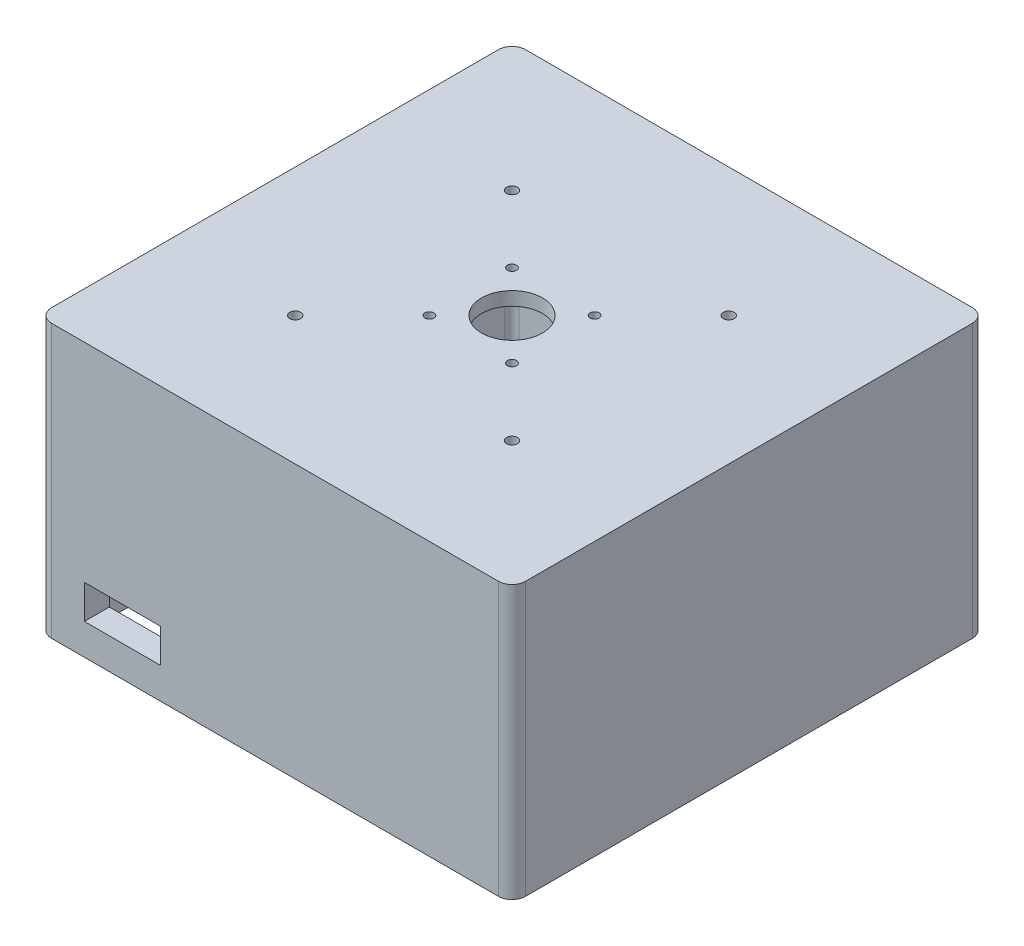
ISO-10303-21;
HEADER;
FILE_DESCRIPTION(('STEP AP214'),'2;1');
FILE_NAME('part.step','',(''),(''),'','','');
FILE_SCHEMA(('AUTOMOTIVE_DESIGN { 1 0 10303 214 1 1 1 1 }'));
ENDSEC;
DATA;
#1=APPLICATION_CONTEXT('core data for automotive mechanical design processes');
#2=APPLICATION_PROTOCOL_DEFINITION('international standard','automotive_design',2000,#1);
#3=PRODUCT_CONTEXT('',#1,'mechanical');
#4=PRODUCT('Part','Part','',(#3));
#5=PRODUCT_RELATED_PRODUCT_CATEGORY('part','',(#4));
#6=PRODUCT_DEFINITION_FORMATION('','',#4);
#7=PRODUCT_DEFINITION_CONTEXT('part definition',#1,'design');
#8=PRODUCT_DEFINITION('design','',#6,#7);
#9=PRODUCT_DEFINITION_SHAPE('','',#8);
#10=(LENGTH_UNIT() NAMED_UNIT(*) SI_UNIT(.MILLI.,.METRE.));
#11=(NAMED_UNIT(*) PLANE_ANGLE_UNIT() SI_UNIT($,.RADIAN.));
#12=(NAMED_UNIT(*) SI_UNIT($,.STERADIAN.) SOLID_ANGLE_UNIT());
#13=UNCERTAINTY_MEASURE_WITH_UNIT(LENGTH_MEASURE(1.E-05),#10,'distance_accuracy_value','');
#14=(GEOMETRIC_REPRESENTATION_CONTEXT(3) GLOBAL_UNCERTAINTY_ASSIGNED_CONTEXT((#13)) GLOBAL_UNIT_ASSIGNED_CONTEXT((#10,
#11,#12)) REPRESENTATION_CONTEXT('',''));
#15=CARTESIAN_POINT('',(0.,0.,0.));
#16=DIRECTION('',(0.,0.,1.));
#17=DIRECTION('',(1.,0.,0.));
#18=AXIS2_PLACEMENT_3D('',#15,#16,#17);
#19=CARTESIAN_POINT('',(0.,-59.182,88.9));
#20=DIRECTION('',(0.,0.,1.));
#21=DIRECTION('',(1.,0.,0.));
#22=AXIS2_PLACEMENT_3D('',#19,#20,#21);
#23=PLANE('',#22);
#24=DIRECTION('',(0.,-1.,0.));
#25=VECTOR('',#24,1.);
#26=CARTESIAN_POINT('',(-71.5107409869842,-34.8243411574687,88.9));
#27=LINE('',#26,#25);
#28=CARTESIAN_POINT('',(-71.5107409869842,-34.8243411574687,88.9));
#29=VERTEX_POINT('',#28);
#30=CARTESIAN_POINT('',(-71.5107409869842,-47.5243411574687,88.9));
#31=VERTEX_POINT('',#30);
#32=EDGE_CURVE('E78',#29,#31,#27,.T.);
#33=ORIENTED_EDGE('',*,*,#32,.F.);
#34=DIRECTION('',(-1.,0.,0.));
#35=VECTOR('',#34,1.);
#36=CARTESIAN_POINT('',(-71.5107409869842,-34.8243411574687,88.9));
#37=LINE('',#36,#35);
#38=CARTESIAN_POINT('',(-42.9357409869842,-34.8243411574687,88.9));
#39=VERTEX_POINT('',#38);
#40=EDGE_CURVE('E219',#39,#29,#37,.T.);
#41=ORIENTED_EDGE('',*,*,#40,.F.);
#42=DIRECTION('',(0.,1.,0.));
#43=VECTOR('',#42,1.);
#44=CARTESIAN_POINT('',(-42.9357409869842,-34.8243411574687,88.9));
#45=LINE('',#44,#43);
#46=CARTESIAN_POINT('',(-42.9357409869842,-47.5243411574687,88.9));
#47=VERTEX_POINT('',#46);
#48=EDGE_CURVE('E202',#47,#39,#45,.T.);
#49=ORIENTED_EDGE('',*,*,#48,.F.);
#50=DIRECTION('',(1.,0.,0.));
#51=VECTOR('',#50,1.);
#52=CARTESIAN_POINT('',(-71.5107409869842,-47.5243411574687,88.9));
#53=LINE('',#52,#51);
#54=EDGE_CURVE('E212',#31,#47,#53,.T.);
#55=ORIENTED_EDGE('',*,*,#54,.F.);
#56=EDGE_LOOP('',(#33,#41,#49,#55));
#57=FACE_BOUND('',#56,.T.);
#58=DIRECTION('',(1.,0.,0.));
#59=VECTOR('',#58,1.);
#60=CARTESIAN_POINT('',(0.,-59.182,88.9));
#61=LINE('',#60,#59);
#62=CARTESIAN_POINT('',(-83.82,-59.182,88.9));
#63=VERTEX_POINT('',#62);
#64=CARTESIAN_POINT('',(83.82,-59.182,88.9));
#65=VERTEX_POINT('',#64);
#66=EDGE_CURVE('E357',#63,#65,#61,.T.);
#67=ORIENTED_EDGE('',*,*,#66,.T.);
#68=DIRECTION('',(0.,1.,0.));
#69=VECTOR('',#68,1.);
#70=CARTESIAN_POINT('',(83.82,-59.182,88.9));
#71=LINE('',#70,#69);
#72=CARTESIAN_POINT('',(83.82,43.18,88.9));
#73=VERTEX_POINT('',#72);
#74=EDGE_CURVE('E421',#65,#73,#71,.T.);
#75=ORIENTED_EDGE('',*,*,#74,.T.);
#76=DIRECTION('',(-1.,0.,0.));
#77=VECTOR('',#76,1.);
#78=CARTESIAN_POINT('',(0.,43.18,88.9));
#79=LINE('',#78,#77);
#80=CARTESIAN_POINT('',(-83.82,43.18,88.9));
#81=VERTEX_POINT('',#80);
#82=EDGE_CURVE('E313',#73,#81,#79,.T.);
#83=ORIENTED_EDGE('',*,*,#82,.T.);
#84=DIRECTION('',(0.,1.,0.));
#85=VECTOR('',#84,1.);
#86=CARTESIAN_POINT('',(-83.82,-59.182,88.9));
#87=LINE('',#86,#85);
#88=EDGE_CURVE('E418',#81,#63,#87,.F.);
#89=ORIENTED_EDGE('',*,*,#88,.T.);
#90=EDGE_LOOP('',(#67,#75,#83,#89));
#91=FACE_BOUND('',#90,.T.);
#92=ADVANCED_FACE('F62',(#57,#91),#23,.T.);
#93=CARTESIAN_POINT('',(-88.9,-59.182,0.));
#94=DIRECTION('',(1.,0.,0.));
#95=DIRECTION('',(0.,0.,-1.));
#96=AXIS2_PLACEMENT_3D('',#93,#94,#95);
#97=PLANE('',#96);
#98=DIRECTION('',(0.,0.,1.));
#99=VECTOR('',#98,1.);
#100=CARTESIAN_POINT('',(-88.9,43.18,0.));
#101=LINE('',#100,#99);
#102=CARTESIAN_POINT('',(-88.9,43.18,-83.82));
#103=VERTEX_POINT('',#102);
#104=CARTESIAN_POINT('',(-88.9,43.18,83.82));
#105=VERTEX_POINT('',#104);
#106=EDGE_CURVE('E306',#103,#105,#101,.T.);
#107=ORIENTED_EDGE('',*,*,#106,.F.);
#108=DIRECTION('',(0.,1.,0.));
#109=VECTOR('',#108,1.);
#110=CARTESIAN_POINT('',(-88.9,-59.182,-83.82));
#111=LINE('',#110,#109);
#112=CARTESIAN_POINT('',(-88.9,-59.182,-83.82));
#113=VERTEX_POINT('',#112);
#114=EDGE_CURVE('E415',#103,#113,#111,.F.);
#115=ORIENTED_EDGE('',*,*,#114,.T.);
#116=DIRECTION('',(0.,0.,-1.));
#117=VECTOR('',#116,1.);
#118=CARTESIAN_POINT('',(-88.9,-59.182,0.));
#119=LINE('',#118,#117);
#120=CARTESIAN_POINT('',(-88.9,-59.182,83.82));
#121=VERTEX_POINT('',#120);
#122=EDGE_CURVE('E369',#121,#113,#119,.T.);
#123=ORIENTED_EDGE('',*,*,#122,.F.);
#124=DIRECTION('',(0.,1.,0.));
#125=VECTOR('',#124,1.);
#126=CARTESIAN_POINT('',(-88.9,43.18,83.82));
#127=LINE('',#126,#125);
#128=EDGE_CURVE('E411',#121,#105,#127,.T.);
#129=ORIENTED_EDGE('',*,*,#128,.T.);
#130=EDGE_LOOP('',(#107,#115,#123,#129));
#131=FACE_BOUND('',#130,.T.);
#132=ADVANCED_FACE('F522',(#131),#97,.F.);
#133=CARTESIAN_POINT('',(0.,-59.182,-88.9));
#134=DIRECTION('',(0.,0.,1.));
#135=DIRECTION('',(1.,0.,0.));
#136=AXIS2_PLACEMENT_3D('',#133,#134,#135);
#137=PLANE('',#136);
#138=DIRECTION('',(-1.,0.,0.));
#139=VECTOR('',#138,1.);
#140=CARTESIAN_POINT('',(0.,43.18,-88.9));
#141=LINE('',#140,#139);
#142=CARTESIAN_POINT('',(83.82,43.18,-88.9));
#143=VERTEX_POINT('',#142);
#144=CARTESIAN_POINT('',(-83.82,43.18,-88.9));
#145=VERTEX_POINT('',#144);
#146=EDGE_CURVE('E321',#143,#145,#141,.T.);
#147=ORIENTED_EDGE('',*,*,#146,.F.);
#148=DIRECTION('',(0.,1.,0.));
#149=VECTOR('',#148,1.);
#150=CARTESIAN_POINT('',(83.82,-59.182,-88.9));
#151=LINE('',#150,#149);
#152=CARTESIAN_POINT('',(83.82,-59.182,-88.9));
#153=VERTEX_POINT('',#152);
#154=EDGE_CURVE('E396',#143,#153,#151,.F.);
#155=ORIENTED_EDGE('',*,*,#154,.T.);
#156=DIRECTION('',(1.,0.,0.));
#157=VECTOR('',#156,1.);
#158=CARTESIAN_POINT('',(0.,-59.182,-88.9));
#159=LINE('',#158,#157);
#160=CARTESIAN_POINT('',(-83.82,-59.182,-88.9));
#161=VERTEX_POINT('',#160);
#162=EDGE_CURVE('E365',#161,#153,#159,.T.);
#163=ORIENTED_EDGE('',*,*,#162,.F.);
#164=DIRECTION('',(0.,1.,0.));
#165=VECTOR('',#164,1.);
#166=CARTESIAN_POINT('',(-83.82,-59.182,-88.9));
#167=LINE('',#166,#165);
#168=EDGE_CURVE('E392',#161,#145,#167,.T.);
#169=ORIENTED_EDGE('',*,*,#168,.T.);
#170=EDGE_LOOP('',(#147,#155,#163,#169));
#171=FACE_BOUND('',#170,.T.);
#172=ADVANCED_FACE('F529',(#171),#137,.F.);
#173=CARTESIAN_POINT('',(79.5394277392496,-59.182,0.));
#174=DIRECTION('',(1.,0.,0.));
#175=DIRECTION('',(0.,0.,-1.));
#176=AXIS2_PLACEMENT_3D('',#173,#174,#175);
#177=PLANE('',#176);
#178=DIRECTION('',(0.,0.,-1.));
#179=VECTOR('',#178,1.);
#180=CARTESIAN_POINT('',(79.5394277392496,-59.182,0.));
#181=LINE('',#180,#179);
#182=CARTESIAN_POINT('',(79.5394277392496,-59.182,76.9994277392495));
#183=VERTEX_POINT('',#182);
#184=CARTESIAN_POINT('',(79.5394277392496,-59.182,-76.9994277392495));
#185=VERTEX_POINT('',#184);
#186=EDGE_CURVE('E341',#183,#185,#181,.T.);
#187=ORIENTED_EDGE('',*,*,#186,.F.);
#188=DIRECTION('',(0.,1.,0.));
#189=VECTOR('',#188,1.);
#190=CARTESIAN_POINT('',(79.5394277392496,38.1,76.9994277392495));
#191=LINE('',#190,#189);
#192=CARTESIAN_POINT('',(79.5394277392496,38.1,76.9994277392495));
#193=VERTEX_POINT('',#192);
#194=EDGE_CURVE('E461',#183,#193,#191,.T.);
#195=ORIENTED_EDGE('',*,*,#194,.T.);
#196=DIRECTION('',(0.,0.,-1.));
#197=VECTOR('',#196,1.);
#198=CARTESIAN_POINT('',(79.5394277392496,38.1,0.));
#199=LINE('',#198,#197);
#200=CARTESIAN_POINT('',(79.5394277392496,38.1,-76.9994277392495));
#201=VERTEX_POINT('',#200);
#202=EDGE_CURVE('E325',#193,#201,#199,.T.);
#203=ORIENTED_EDGE('',*,*,#202,.T.);
#204=DIRECTION('',(0.,1.,0.));
#205=VECTOR('',#204,1.);
#206=CARTESIAN_POINT('',(79.5394277392496,-59.182,-76.9994277392495));
#207=LINE('',#206,#205);
#208=EDGE_CURVE('E458',#201,#185,#207,.F.);
#209=ORIENTED_EDGE('',*,*,#208,.T.);
#210=EDGE_LOOP('',(#187,#195,#203,#209));
#211=FACE_BOUND('',#210,.T.);
#212=ADVANCED_FACE('F482',(#211),#177,.F.);
#213=CARTESIAN_POINT('',(0.,-59.182,-79.5394277392495));
#214=DIRECTION('',(0.,0.,1.));
#215=DIRECTION('',(1.,0.,0.));
#216=AXIS2_PLACEMENT_3D('',#213,#214,#215);
#217=PLANE('',#216);
#218=DIRECTION('',(1.,0.,0.));
#219=VECTOR('',#218,1.);
#220=CARTESIAN_POINT('',(0.,38.1,-79.5394277392495));
#221=LINE('',#220,#219);
#222=CARTESIAN_POINT('',(-76.9994277392495,38.1,-79.5394277392495));
#223=VERTEX_POINT('',#222);
#224=CARTESIAN_POINT('',(76.9994277392496,38.1,-79.5394277392495));
#225=VERTEX_POINT('',#224);
#226=EDGE_CURVE('E337',#223,#225,#221,.T.);
#227=ORIENTED_EDGE('',*,*,#226,.F.);
#228=DIRECTION('',(0.,1.,0.));
#229=VECTOR('',#228,1.);
#230=CARTESIAN_POINT('',(-76.9994277392495,-59.182,-79.5394277392495));
#231=LINE('',#230,#229);
#232=CARTESIAN_POINT('',(-76.9994277392495,-59.182,-79.5394277392495));
#233=VERTEX_POINT('',#232);
#234=EDGE_CURVE('E448',#223,#233,#231,.F.);
#235=ORIENTED_EDGE('',*,*,#234,.T.);
#236=DIRECTION('',(1.,0.,0.));
#237=VECTOR('',#236,1.);
#238=CARTESIAN_POINT('',(0.,-59.182,-79.5394277392495));
#239=LINE('',#238,#237);
#240=CARTESIAN_POINT('',(76.9994277392496,-59.182,-79.5394277392495));
#241=VERTEX_POINT('',#240);
#242=EDGE_CURVE('E353',#233,#241,#239,.T.);
#243=ORIENTED_EDGE('',*,*,#242,.T.);
#244=DIRECTION('',(0.,1.,0.));
#245=VECTOR('',#244,1.);
#246=CARTESIAN_POINT('',(76.9994277392496,-59.182,-79.5394277392495));
#247=LINE('',#246,#245);
#248=EDGE_CURVE('E444',#241,#225,#247,.T.);
#249=ORIENTED_EDGE('',*,*,#248,.T.);
#250=EDGE_LOOP('',(#227,#235,#243,#249));
#251=FACE_BOUND('',#250,.T.);
#252=ADVANCED_FACE('F507',(#251),#217,.T.);
#253=CARTESIAN_POINT('',(-79.5394277392495,-59.182,0.));
#254=DIRECTION('',(1.,0.,0.));
#255=DIRECTION('',(0.,0.,-1.));
#256=AXIS2_PLACEMENT_3D('',#253,#254,#255);
#257=PLANE('',#256);
#258=DIRECTION('',(0.,0.,-1.));
#259=VECTOR('',#258,1.);
#260=CARTESIAN_POINT('',(-79.5394277392495,-59.182,0.));
#261=LINE('',#260,#259);
#262=CARTESIAN_POINT('',(-79.5394277392495,-59.182,76.9994277392495));
#263=VERTEX_POINT('',#262);
#264=CARTESIAN_POINT('',(-79.5394277392495,-59.182,-76.9994277392495));
#265=VERTEX_POINT('',#264);
#266=EDGE_CURVE('E349',#263,#265,#261,.T.);
#267=ORIENTED_EDGE('',*,*,#266,.T.);
#268=DIRECTION('',(0.,1.,0.));
#269=VECTOR('',#268,1.);
#270=CARTESIAN_POINT('',(-79.5394277392495,38.1,-76.9994277392495));
#271=LINE('',#270,#269);
#272=CARTESIAN_POINT('',(-79.5394277392495,38.1,-76.9994277392495));
#273=VERTEX_POINT('',#272);
#274=EDGE_CURVE('E428',#265,#273,#271,.T.);
#275=ORIENTED_EDGE('',*,*,#274,.T.);
#276=DIRECTION('',(0.,0.,-1.));
#277=VECTOR('',#276,1.);
#278=CARTESIAN_POINT('',(-79.5394277392495,38.1,0.));
#279=LINE('',#278,#277);
#280=CARTESIAN_POINT('',(-79.5394277392495,38.1,76.9994277392495));
#281=VERTEX_POINT('',#280);
#282=EDGE_CURVE('E333',#281,#273,#279,.T.);
#283=ORIENTED_EDGE('',*,*,#282,.F.);
#284=DIRECTION('',(0.,1.,0.));
#285=VECTOR('',#284,1.);
#286=CARTESIAN_POINT('',(-79.5394277392495,-59.182,76.9994277392495));
#287=LINE('',#286,#285);
#288=EDGE_CURVE('E425',#281,#263,#287,.F.);
#289=ORIENTED_EDGE('',*,*,#288,.T.);
#290=EDGE_LOOP('',(#267,#275,#283,#289));
#291=FACE_BOUND('',#290,.T.);
#292=ADVANCED_FACE('F498',(#291),#257,.T.);
#293=CARTESIAN_POINT('',(0.,-59.182,79.5394277392495));
#294=DIRECTION('',(0.,0.,1.));
#295=DIRECTION('',(1.,0.,0.));
#296=AXIS2_PLACEMENT_3D('',#293,#294,#295);
#297=PLANE('',#296);
#298=DIRECTION('',(1.,0.,0.));
#299=VECTOR('',#298,1.);
#300=CARTESIAN_POINT('',(-71.5107409869842,-34.8243411574687,79.5394277392495));
#301=LINE('',#300,#299);
#302=CARTESIAN_POINT('',(-71.5107409869842,-34.8243411574687,79.5394277392495));
#303=VERTEX_POINT('',#302);
#304=CARTESIAN_POINT('',(-42.9357409869842,-34.8243411574687,79.5394277392495));
#305=VERTEX_POINT('',#304);
#306=EDGE_CURVE('E888',#303,#305,#301,.T.);
#307=ORIENTED_EDGE('',*,*,#306,.F.);
#308=DIRECTION('',(0.,1.,0.));
#309=VECTOR('',#308,1.);
#310=CARTESIAN_POINT('',(-71.5107409869842,-34.8243411574687,79.5394277392495));
#311=LINE('',#310,#309);
#312=CARTESIAN_POINT('',(-71.5107409869842,-47.5243411574687,79.5394277392495));
#313=VERTEX_POINT('',#312);
#314=EDGE_CURVE('E237',#313,#303,#311,.T.);
#315=ORIENTED_EDGE('',*,*,#314,.F.);
#316=DIRECTION('',(-1.,0.,0.));
#317=VECTOR('',#316,1.);
#318=CARTESIAN_POINT('',(-71.5107409869842,-47.5243411574687,79.5394277392495));
#319=LINE('',#318,#317);
#320=CARTESIAN_POINT('',(-42.9357409869842,-47.5243411574687,79.5394277392495));
#321=VERTEX_POINT('',#320);
#322=EDGE_CURVE('E233',#321,#313,#319,.T.);
#323=ORIENTED_EDGE('',*,*,#322,.F.);
#324=DIRECTION('',(0.,-1.,0.));
#325=VECTOR('',#324,1.);
#326=CARTESIAN_POINT('',(-42.9357409869842,-34.8243411574687,79.5394277392495));
#327=LINE('',#326,#325);
#328=EDGE_CURVE('E205',#305,#321,#327,.T.);
#329=ORIENTED_EDGE('',*,*,#328,.F.);
#330=EDGE_LOOP('',(#307,#315,#323,#329));
#331=FACE_BOUND('',#330,.T.);
#332=DIRECTION('',(1.,0.,0.));
#333=VECTOR('',#332,1.);
#334=CARTESIAN_POINT('',(0.,-59.182,79.5394277392495));
#335=LINE('',#334,#333);
#336=CARTESIAN_POINT('',(-76.9994277392495,-59.182,79.5394277392495));
#337=VERTEX_POINT('',#336);
#338=CARTESIAN_POINT('',(76.9994277392496,-59.182,79.5394277392495));
#339=VERTEX_POINT('',#338);
#340=EDGE_CURVE('E345',#337,#339,#335,.T.);
#341=ORIENTED_EDGE('',*,*,#340,.F.);
#342=DIRECTION('',(0.,1.,0.));
#343=VECTOR('',#342,1.);
#344=CARTESIAN_POINT('',(-76.9994277392495,-59.182,79.5394277392495));
#345=LINE('',#344,#343);
#346=CARTESIAN_POINT('',(-76.9994277392495,38.1,79.5394277392495));
#347=VERTEX_POINT('',#346);
#348=EDGE_CURVE('E454',#337,#347,#345,.T.);
#349=ORIENTED_EDGE('',*,*,#348,.T.);
#350=DIRECTION('',(1.,0.,0.));
#351=VECTOR('',#350,1.);
#352=CARTESIAN_POINT('',(0.,38.1,79.5394277392495));
#353=LINE('',#352,#351);
#354=CARTESIAN_POINT('',(76.9994277392496,38.1,79.5394277392495));
#355=VERTEX_POINT('',#354);
#356=EDGE_CURVE('E329',#347,#355,#353,.T.);
#357=ORIENTED_EDGE('',*,*,#356,.T.);
#358=DIRECTION('',(0.,1.,0.));
#359=VECTOR('',#358,1.);
#360=CARTESIAN_POINT('',(76.9994277392496,-59.182,79.5394277392495));
#361=LINE('',#360,#359);
#362=EDGE_CURVE('E451',#355,#339,#361,.F.);
#363=ORIENTED_EDGE('',*,*,#362,.T.);
#364=EDGE_LOOP('',(#341,#349,#357,#363));
#365=FACE_BOUND('',#364,.T.);
#366=ADVANCED_FACE('F490',(#331,#365),#297,.F.);
#367=CARTESIAN_POINT('',(88.9,-59.182,0.));
#368=DIRECTION('',(1.,0.,0.));
#369=DIRECTION('',(0.,0.,-1.));
#370=AXIS2_PLACEMENT_3D('',#367,#368,#369);
#371=PLANE('',#370);
#372=DIRECTION('',(0.,0.,-1.));
#373=VECTOR('',#372,1.);
#374=CARTESIAN_POINT('',(88.9,-59.182,0.));
#375=LINE('',#374,#373);
#376=CARTESIAN_POINT('',(88.9,-59.182,83.82));
#377=VERTEX_POINT('',#376);
#378=CARTESIAN_POINT('',(88.9,-59.182,-83.82));
#379=VERTEX_POINT('',#378);
#380=EDGE_CURVE('E361',#377,#379,#375,.T.);
#381=ORIENTED_EDGE('',*,*,#380,.T.);
#382=DIRECTION('',(0.,1.,0.));
#383=VECTOR('',#382,1.);
#384=CARTESIAN_POINT('',(88.9,43.18,-83.82));
#385=LINE('',#384,#383);
#386=CARTESIAN_POINT('',(88.9,43.18,-83.82));
#387=VERTEX_POINT('',#386);
#388=EDGE_CURVE('E376',#379,#387,#385,.T.);
#389=ORIENTED_EDGE('',*,*,#388,.T.);
#390=DIRECTION('',(0.,0.,1.));
#391=VECTOR('',#390,1.);
#392=CARTESIAN_POINT('',(88.9,43.18,0.));
#393=LINE('',#392,#391);
#394=CARTESIAN_POINT('',(88.9,43.18,83.82));
#395=VERTEX_POINT('',#394);
#396=EDGE_CURVE('E317',#387,#395,#393,.T.);
#397=ORIENTED_EDGE('',*,*,#396,.T.);
#398=DIRECTION('',(0.,1.,0.));
#399=VECTOR('',#398,1.);
#400=CARTESIAN_POINT('',(88.9,-59.182,83.82));
#401=LINE('',#400,#399);
#402=EDGE_CURVE('E373',#395,#377,#401,.F.);
#403=ORIENTED_EDGE('',*,*,#402,.T.);
#404=EDGE_LOOP('',(#381,#389,#397,#403));
#405=FACE_BOUND('',#404,.T.);
#406=ADVANCED_FACE('F534',(#405),#371,.T.);
#407=CARTESIAN_POINT('',(0.,-59.182,0.));
#408=DIRECTION('',(0.,1.,0.));
#409=DIRECTION('',(0.,0.,1.));
#410=AXIS2_PLACEMENT_3D('',#407,#408,#409);
#411=PLANE('',#410);
#412=ORIENTED_EDGE('',*,*,#340,.T.);
#413=CARTESIAN_POINT('',(76.9994277392496,-59.182,76.9994277392495));
#414=DIRECTION('',(0.,1.,0.));
#415=DIRECTION('',(0.,0.,1.));
#416=AXIS2_PLACEMENT_3D('',#413,#414,#415);
#417=CIRCLE('',#416,2.54);
#418=EDGE_CURVE('E71',#339,#183,#417,.T.);
#419=ORIENTED_EDGE('',*,*,#418,.T.);
#420=ORIENTED_EDGE('',*,*,#186,.T.);
#421=CARTESIAN_POINT('',(76.9994277392496,-59.182,-76.9994277392495));
#422=DIRECTION('',(0.,1.,0.));
#423=DIRECTION('',(0.,0.,1.));
#424=AXIS2_PLACEMENT_3D('',#421,#422,#423);
#425=CIRCLE('',#424,2.54);
#426=EDGE_CURVE('E12',#185,#241,#425,.T.);
#427=ORIENTED_EDGE('',*,*,#426,.T.);
#428=ORIENTED_EDGE('',*,*,#242,.F.);
#429=CARTESIAN_POINT('',(-76.9994277392495,-59.182,-76.9994277392495));
#430=DIRECTION('',(0.,1.,0.));
#431=DIRECTION('',(0.,0.,1.));
#432=AXIS2_PLACEMENT_3D('',#429,#430,#431);
#433=CIRCLE('',#432,2.54);
#434=EDGE_CURVE('E465',#233,#265,#433,.T.);
#435=ORIENTED_EDGE('',*,*,#434,.T.);
#436=ORIENTED_EDGE('',*,*,#266,.F.);
#437=CARTESIAN_POINT('',(-76.9994277392495,-59.182,76.9994277392495));
#438=DIRECTION('',(0.,1.,0.));
#439=DIRECTION('',(0.,0.,1.));
#440=AXIS2_PLACEMENT_3D('',#437,#438,#439);
#441=CIRCLE('',#440,2.54);
#442=EDGE_CURVE('E468',#263,#337,#441,.T.);
#443=ORIENTED_EDGE('',*,*,#442,.T.);
#444=EDGE_LOOP('',(#412,#419,#420,#427,#428,#435,#436,#443));
#445=FACE_BOUND('',#444,.T.);
#446=ORIENTED_EDGE('',*,*,#162,.T.);
#447=CARTESIAN_POINT('',(83.82,-59.182,-83.82));
#448=DIRECTION('',(0.,1.,0.));
#449=DIRECTION('',(0.,0.,1.));
#450=AXIS2_PLACEMENT_3D('',#447,#448,#449);
#451=CIRCLE('',#450,5.08);
#452=EDGE_CURVE('E408',#153,#379,#451,.F.);
#453=ORIENTED_EDGE('',*,*,#452,.T.);
#454=ORIENTED_EDGE('',*,*,#380,.F.);
#455=CARTESIAN_POINT('',(83.82,-59.182,83.82));
#456=DIRECTION('',(0.,1.,0.));
#457=DIRECTION('',(0.,0.,1.));
#458=AXIS2_PLACEMENT_3D('',#455,#456,#457);
#459=CIRCLE('',#458,5.08);
#460=EDGE_CURVE('E402',#377,#65,#459,.F.);
#461=ORIENTED_EDGE('',*,*,#460,.T.);
#462=ORIENTED_EDGE('',*,*,#66,.F.);
#463=CARTESIAN_POINT('',(-83.82,-59.182,83.82));
#464=DIRECTION('',(0.,1.,0.));
#465=DIRECTION('',(0.,0.,1.));
#466=AXIS2_PLACEMENT_3D('',#463,#464,#465);
#467=CIRCLE('',#466,5.08);
#468=EDGE_CURVE('E399',#63,#121,#467,.F.);
#469=ORIENTED_EDGE('',*,*,#468,.T.);
#470=ORIENTED_EDGE('',*,*,#122,.T.);
#471=CARTESIAN_POINT('',(-83.82,-59.182,-83.82));
#472=DIRECTION('',(0.,1.,0.));
#473=DIRECTION('',(0.,0.,1.));
#474=AXIS2_PLACEMENT_3D('',#471,#472,#473);
#475=CIRCLE('',#474,5.08);
#476=EDGE_CURVE('E405',#113,#161,#475,.F.);
#477=ORIENTED_EDGE('',*,*,#476,.T.);
#478=EDGE_LOOP('',(#446,#453,#454,#461,#462,#469,#470,#477));
#479=FACE_BOUND('',#478,.T.);
#480=ADVANCED_FACE('F474',(#445,#479),#411,.F.);
#481=CARTESIAN_POINT('',(0.,38.1,0.));
#482=DIRECTION('',(0.,-1.,0.));
#483=DIRECTION('',(0.,0.,-1.));
#484=AXIS2_PLACEMENT_3D('',#481,#482,#483);
#485=PLANE('',#484);
#486=CARTESIAN_POINT('',(40.6599999999999,38.1,40.6600000000001));
#487=DIRECTION('',(0.,-1.,0.));
#488=DIRECTION('',(0.,0.,-1.));
#489=AXIS2_PLACEMENT_3D('',#486,#487,#488);
#490=CIRCLE('',#489,2.04999999999998);
#491=CARTESIAN_POINT('',(40.6599999999999,38.1,38.6100000000001));
#492=VERTEX_POINT('',#491);
#493=EDGE_CURVE('E236',#492,#492,#490,.F.);
#494=ORIENTED_EDGE('',*,*,#493,.T.);
#495=EDGE_LOOP('',(#494));
#496=FACE_BOUND('',#495,.T.);
#497=CARTESIAN_POINT('',(-40.6599999999999,38.1,40.6600000000001));
#498=DIRECTION('',(0.,-1.,0.));
#499=DIRECTION('',(0.,0.,-1.));
#500=AXIS2_PLACEMENT_3D('',#497,#498,#499);
#501=CIRCLE('',#500,2.04999999999998);
#502=CARTESIAN_POINT('',(-40.6599999999999,38.1,38.6100000000002));
#503=VERTEX_POINT('',#502);
#504=EDGE_CURVE('E248',#503,#503,#501,.F.);
#505=ORIENTED_EDGE('',*,*,#504,.T.);
#506=EDGE_LOOP('',(#505));
#507=FACE_BOUND('',#506,.T.);
#508=CARTESIAN_POINT('',(-40.66,38.1,-40.66));
#509=DIRECTION('',(0.,-1.,0.));
#510=DIRECTION('',(0.,0.,-1.));
#511=AXIS2_PLACEMENT_3D('',#508,#509,#510);
#512=CIRCLE('',#511,2.04999999999999);
#513=CARTESIAN_POINT('',(-40.66,38.1,-42.71));
#514=VERTEX_POINT('',#513);
#515=EDGE_CURVE('E238',#514,#514,#512,.F.);
#516=ORIENTED_EDGE('',*,*,#515,.T.);
#517=EDGE_LOOP('',(#516));
#518=FACE_BOUND('',#517,.T.);
#519=CARTESIAN_POINT('',(40.6599999999999,38.1,-40.66));
#520=DIRECTION('',(0.,-1.,0.));
#521=DIRECTION('',(0.,0.,-1.));
#522=AXIS2_PLACEMENT_3D('',#519,#520,#521);
#523=CIRCLE('',#522,2.04999999999999);
#524=CARTESIAN_POINT('',(40.6599999999999,38.1,-42.71));
#525=VERTEX_POINT('',#524);
#526=EDGE_CURVE('E265',#525,#525,#523,.F.);
#527=ORIENTED_EDGE('',*,*,#526,.T.);
#528=EDGE_LOOP('',(#527));
#529=FACE_BOUND('',#528,.T.);
#530=CARTESIAN_POINT('',(15.4999999999998,38.1,15.5000000000001));
#531=DIRECTION('',(0.,-1.,0.));
#532=DIRECTION('',(0.,0.,-1.));
#533=AXIS2_PLACEMENT_3D('',#530,#531,#532);
#534=CIRCLE('',#533,1.69999999999993);
#535=CARTESIAN_POINT('',(15.4999999999998,38.1,13.8000000000002));
#536=VERTEX_POINT('',#535);
#537=EDGE_CURVE('E297',#536,#536,#534,.T.);
#538=ORIENTED_EDGE('',*,*,#537,.F.);
#539=EDGE_LOOP('',(#538));
#540=FACE_BOUND('',#539,.T.);
#541=CARTESIAN_POINT('',(15.4999999999999,38.1,-15.5));
#542=DIRECTION('',(0.,-1.,0.));
#543=DIRECTION('',(0.,0.,-1.));
#544=AXIS2_PLACEMENT_3D('',#541,#542,#543);
#545=CIRCLE('',#544,1.69999999999996);
#546=CARTESIAN_POINT('',(15.4999999999999,38.1,-17.2));
#547=VERTEX_POINT('',#546);
#548=EDGE_CURVE('E293',#547,#547,#545,.T.);
#549=ORIENTED_EDGE('',*,*,#548,.F.);
#550=EDGE_LOOP('',(#549));
#551=FACE_BOUND('',#550,.T.);
#552=CARTESIAN_POINT('',(-15.5,38.1,-15.5));
#553=DIRECTION('',(0.,-1.,0.));
#554=DIRECTION('',(0.,0.,-1.));
#555=AXIS2_PLACEMENT_3D('',#552,#553,#554);
#556=CIRCLE('',#555,1.69999999999996);
#557=CARTESIAN_POINT('',(-15.5,38.1,-17.2));
#558=VERTEX_POINT('',#557);
#559=EDGE_CURVE('E289',#558,#558,#556,.T.);
#560=ORIENTED_EDGE('',*,*,#559,.F.);
#561=EDGE_LOOP('',(#560));
#562=FACE_BOUND('',#561,.T.);
#563=CARTESIAN_POINT('',(-15.5,38.1,15.5000000000001));
#564=DIRECTION('',(0.,-1.,0.));
#565=DIRECTION('',(0.,0.,-1.));
#566=AXIS2_PLACEMENT_3D('',#563,#564,#565);
#567=CIRCLE('',#566,1.69999999999995);
#568=CARTESIAN_POINT('',(-15.5,38.1,13.8000000000002));
#569=VERTEX_POINT('',#568);
#570=EDGE_CURVE('E285',#569,#569,#567,.T.);
#571=ORIENTED_EDGE('',*,*,#570,.F.);
#572=EDGE_LOOP('',(#571));
#573=FACE_BOUND('',#572,.T.);
#574=CARTESIAN_POINT('',(0.,38.1,0.));
#575=DIRECTION('',(0.,1.,0.));
#576=DIRECTION('',(0.,0.,1.));
#577=AXIS2_PLACEMENT_3D('',#574,#575,#576);
#578=CIRCLE('',#577,11.43);
#579=CARTESIAN_POINT('',(0.,38.1,11.43));
#580=VERTEX_POINT('',#579);
#581=EDGE_CURVE('E301',#580,#580,#578,.T.);
#582=ORIENTED_EDGE('',*,*,#581,.T.);
#583=EDGE_LOOP('',(#582));
#584=FACE_BOUND('',#583,.T.);
#585=ORIENTED_EDGE('',*,*,#282,.T.);
#586=CARTESIAN_POINT('',(-76.9994277392495,38.1,-76.9994277392495));
#587=DIRECTION('',(0.,-1.,0.));
#588=DIRECTION('',(0.,0.,-1.));
#589=AXIS2_PLACEMENT_3D('',#586,#587,#588);
#590=CIRCLE('',#589,2.54);
#591=EDGE_CURVE('E441',#273,#223,#590,.T.);
#592=ORIENTED_EDGE('',*,*,#591,.T.);
#593=ORIENTED_EDGE('',*,*,#226,.T.);
#594=CARTESIAN_POINT('',(76.9994277392496,38.1,-76.9994277392495));
#595=DIRECTION('',(0.,-1.,0.));
#596=DIRECTION('',(0.,0.,-1.));
#597=AXIS2_PLACEMENT_3D('',#594,#595,#596);
#598=CIRCLE('',#597,2.54);
#599=EDGE_CURVE('E432',#225,#201,#598,.T.);
#600=ORIENTED_EDGE('',*,*,#599,.T.);
#601=ORIENTED_EDGE('',*,*,#202,.F.);
#602=CARTESIAN_POINT('',(76.9994277392496,38.1,76.9994277392495));
#603=DIRECTION('',(0.,-1.,0.));
#604=DIRECTION('',(0.,0.,-1.));
#605=AXIS2_PLACEMENT_3D('',#602,#603,#604);
#606=CIRCLE('',#605,2.54);
#607=EDGE_CURVE('E435',#193,#355,#606,.T.);
#608=ORIENTED_EDGE('',*,*,#607,.T.);
#609=ORIENTED_EDGE('',*,*,#356,.F.);
#610=CARTESIAN_POINT('',(-76.9994277392495,38.1,76.9994277392495));
#611=DIRECTION('',(0.,-1.,0.));
#612=DIRECTION('',(0.,0.,-1.));
#613=AXIS2_PLACEMENT_3D('',#610,#611,#612);
#614=CIRCLE('',#613,2.54);
#615=EDGE_CURVE('E438',#347,#281,#614,.T.);
#616=ORIENTED_EDGE('',*,*,#615,.T.);
#617=EDGE_LOOP('',(#585,#592,#593,#600,#601,#608,#609,#616));
#618=FACE_BOUND('',#617,.T.);
#619=ADVANCED_FACE('F488',(#496,#507,#518,#529,#540,#551,#562,#573,#584,#618),#485,.T.);
#620=CARTESIAN_POINT('',(0.,43.18,0.));
#621=DIRECTION('',(0.,-1.,0.));
#622=DIRECTION('',(0.,0.,-1.));
#623=AXIS2_PLACEMENT_3D('',#620,#621,#622);
#624=PLANE('',#623);
#625=CARTESIAN_POINT('',(40.6599999999999,43.18,40.6600000000001));
#626=DIRECTION('',(0.,1.,0.));
#627=DIRECTION('',(0.,0.,1.));
#628=AXIS2_PLACEMENT_3D('',#625,#626,#627);
#629=CIRCLE('',#628,2.04999999999998);
#630=CARTESIAN_POINT('',(40.6599999999999,43.18,42.7100000000001));
#631=VERTEX_POINT('',#630);
#632=EDGE_CURVE('E252',#631,#631,#629,.T.);
#633=ORIENTED_EDGE('',*,*,#632,.F.);
#634=EDGE_LOOP('',(#633));
#635=FACE_BOUND('',#634,.T.);
#636=CARTESIAN_POINT('',(-40.6599999999999,43.18,40.6600000000001));
#637=DIRECTION('',(0.,1.,0.));
#638=DIRECTION('',(0.,0.,-1.));
#639=AXIS2_PLACEMENT_3D('',#636,#637,#638);
#640=CIRCLE('',#639,2.04999999999998);
#641=CARTESIAN_POINT('',(-40.6599999999999,43.18,38.6100000000002));
#642=VERTEX_POINT('',#641);
#643=EDGE_CURVE('E243',#642,#642,#640,.T.);
#644=ORIENTED_EDGE('',*,*,#643,.F.);
#645=EDGE_LOOP('',(#644));
#646=FACE_BOUND('',#645,.T.);
#647=CARTESIAN_POINT('',(-40.66,43.18,-40.66));
#648=DIRECTION('',(0.,1.,0.));
#649=DIRECTION('',(0.,0.,1.));
#650=AXIS2_PLACEMENT_3D('',#647,#648,#649);
#651=CIRCLE('',#650,2.04999999999999);
#652=CARTESIAN_POINT('',(-40.66,43.18,-38.61));
#653=VERTEX_POINT('',#652);
#654=EDGE_CURVE('E242',#653,#653,#651,.T.);
#655=ORIENTED_EDGE('',*,*,#654,.F.);
#656=EDGE_LOOP('',(#655));
#657=FACE_BOUND('',#656,.T.);
#658=CARTESIAN_POINT('',(40.6599999999999,43.18,-40.66));
#659=DIRECTION('',(0.,1.,0.));
#660=DIRECTION('',(0.,0.,-1.));
#661=AXIS2_PLACEMENT_3D('',#658,#659,#660);
#662=CIRCLE('',#661,2.04999999999999);
#663=CARTESIAN_POINT('',(40.6599999999999,43.18,-42.71));
#664=VERTEX_POINT('',#663);
#665=EDGE_CURVE('E247',#664,#664,#662,.T.);
#666=ORIENTED_EDGE('',*,*,#665,.F.);
#667=EDGE_LOOP('',(#666));
#668=FACE_BOUND('',#667,.T.);
#669=CARTESIAN_POINT('',(15.4999999999998,43.18,15.5000000000001));
#670=DIRECTION('',(0.,1.,0.));
#671=DIRECTION('',(0.,0.,1.));
#672=AXIS2_PLACEMENT_3D('',#669,#670,#671);
#673=CIRCLE('',#672,1.69999999999993);
#674=CARTESIAN_POINT('',(15.4999999999998,43.18,17.2));
#675=VERTEX_POINT('',#674);
#676=EDGE_CURVE('E269',#675,#675,#673,.T.);
#677=ORIENTED_EDGE('',*,*,#676,.F.);
#678=EDGE_LOOP('',(#677));
#679=FACE_BOUND('',#678,.T.);
#680=CARTESIAN_POINT('',(15.4999999999999,43.18,-15.5));
#681=DIRECTION('',(0.,1.,0.));
#682=DIRECTION('',(0.,0.,-1.));
#683=AXIS2_PLACEMENT_3D('',#680,#681,#682);
#684=CIRCLE('',#683,1.69999999999996);
#685=CARTESIAN_POINT('',(15.4999999999999,43.18,-17.2));
#686=VERTEX_POINT('',#685);
#687=EDGE_CURVE('E275',#686,#686,#684,.T.);
#688=ORIENTED_EDGE('',*,*,#687,.F.);
#689=EDGE_LOOP('',(#688));
#690=FACE_BOUND('',#689,.T.);
#691=CARTESIAN_POINT('',(-15.5,43.18,-15.5));
#692=DIRECTION('',(0.,1.,0.));
#693=DIRECTION('',(0.,0.,1.));
#694=AXIS2_PLACEMENT_3D('',#691,#692,#693);
#695=CIRCLE('',#694,1.69999999999996);
#696=CARTESIAN_POINT('',(-15.5,43.18,-13.8));
#697=VERTEX_POINT('',#696);
#698=EDGE_CURVE('E270',#697,#697,#695,.T.);
#699=ORIENTED_EDGE('',*,*,#698,.F.);
#700=EDGE_LOOP('',(#699));
#701=FACE_BOUND('',#700,.T.);
#702=CARTESIAN_POINT('',(-15.5,43.18,15.5000000000001));
#703=DIRECTION('',(0.,1.,0.));
#704=DIRECTION('',(0.,0.,-1.));
#705=AXIS2_PLACEMENT_3D('',#702,#703,#704);
#706=CIRCLE('',#705,1.69999999999995);
#707=CARTESIAN_POINT('',(-15.5,43.18,13.8000000000002));
#708=VERTEX_POINT('',#707);
#709=EDGE_CURVE('E274',#708,#708,#706,.T.);
#710=ORIENTED_EDGE('',*,*,#709,.F.);
#711=EDGE_LOOP('',(#710));
#712=FACE_BOUND('',#711,.T.);
#713=ORIENTED_EDGE('',*,*,#396,.F.);
#714=CARTESIAN_POINT('',(83.82,43.18,-83.82));
#715=DIRECTION('',(0.,-1.,0.));
#716=DIRECTION('',(0.,0.,-1.));
#717=AXIS2_PLACEMENT_3D('',#714,#715,#716);
#718=CIRCLE('',#717,5.08);
#719=EDGE_CURVE('E389',#387,#143,#718,.F.);
#720=ORIENTED_EDGE('',*,*,#719,.T.);
#721=ORIENTED_EDGE('',*,*,#146,.T.);
#722=CARTESIAN_POINT('',(-83.82,43.18,-83.82));
#723=DIRECTION('',(0.,-1.,0.));
#724=DIRECTION('',(0.,0.,-1.));
#725=AXIS2_PLACEMENT_3D('',#722,#723,#724);
#726=CIRCLE('',#725,5.08);
#727=EDGE_CURVE('E386',#145,#103,#726,.F.);
#728=ORIENTED_EDGE('',*,*,#727,.T.);
#729=ORIENTED_EDGE('',*,*,#106,.T.);
#730=CARTESIAN_POINT('',(-83.82,43.18,83.82));
#731=DIRECTION('',(0.,-1.,0.));
#732=DIRECTION('',(0.,0.,-1.));
#733=AXIS2_PLACEMENT_3D('',#730,#731,#732);
#734=CIRCLE('',#733,5.08);
#735=EDGE_CURVE('E380',#105,#81,#734,.F.);
#736=ORIENTED_EDGE('',*,*,#735,.T.);
#737=ORIENTED_EDGE('',*,*,#82,.F.);
#738=CARTESIAN_POINT('',(83.82,43.18,83.82));
#739=DIRECTION('',(0.,-1.,0.));
#740=DIRECTION('',(0.,0.,-1.));
#741=AXIS2_PLACEMENT_3D('',#738,#739,#740);
#742=CIRCLE('',#741,5.08);
#743=EDGE_CURVE('E383',#73,#395,#742,.F.);
#744=ORIENTED_EDGE('',*,*,#743,.T.);
#745=EDGE_LOOP('',(#713,#720,#721,#728,#729,#736,#737,#744));
#746=FACE_BOUND('',#745,.T.);
#747=CARTESIAN_POINT('',(0.,43.18,0.));
#748=DIRECTION('',(0.,1.,0.));
#749=DIRECTION('',(0.,0.,1.));
#750=AXIS2_PLACEMENT_3D('',#747,#748,#749);
#751=CIRCLE('',#750,11.43);
#752=CARTESIAN_POINT('',(0.,43.18,11.43));
#753=VERTEX_POINT('',#752);
#754=EDGE_CURVE('E302',#753,#753,#751,.T.);
#755=ORIENTED_EDGE('',*,*,#754,.F.);
#756=EDGE_LOOP('',(#755));
#757=FACE_BOUND('',#756,.T.);
#758=ADVANCED_FACE('F671',(#635,#646,#657,#668,#679,#690,#701,#712,#746,#757),#624,.F.);
#759=CARTESIAN_POINT('',(0.,43.18,0.));
#760=DIRECTION('',(0.,-1.,0.));
#761=DIRECTION('',(0.,0.,-1.));
#762=AXIS2_PLACEMENT_3D('',#759,#760,#761);
#763=CYLINDRICAL_SURFACE('',#762,11.43);
#764=ORIENTED_EDGE('',*,*,#754,.T.);
#765=EDGE_LOOP('',(#764));
#766=FACE_BOUND('',#765,.T.);
#767=ORIENTED_EDGE('',*,*,#581,.F.);
#768=EDGE_LOOP('',(#767));
#769=FACE_BOUND('',#768,.T.);
#770=ADVANCED_FACE('F548',(#766,#769),#763,.F.);
#771=CARTESIAN_POINT('',(83.82,-59.182,-83.82));
#772=DIRECTION('',(0.,-1.,0.));
#773=DIRECTION('',(0.,0.,-1.));
#774=AXIS2_PLACEMENT_3D('',#771,#772,#773);
#775=CYLINDRICAL_SURFACE('',#774,5.08);
#776=ORIENTED_EDGE('',*,*,#452,.F.);
#777=ORIENTED_EDGE('',*,*,#154,.F.);
#778=ORIENTED_EDGE('',*,*,#719,.F.);
#779=ORIENTED_EDGE('',*,*,#388,.F.);
#780=EDGE_LOOP('',(#776,#777,#778,#779));
#781=FACE_BOUND('',#780,.T.);
#782=ADVANCED_FACE('F544',(#781),#775,.T.);
#783=CARTESIAN_POINT('',(-83.82,-59.182,-83.82));
#784=DIRECTION('',(0.,1.,0.));
#785=DIRECTION('',(0.,0.,1.));
#786=AXIS2_PLACEMENT_3D('',#783,#784,#785);
#787=CYLINDRICAL_SURFACE('',#786,5.08);
#788=ORIENTED_EDGE('',*,*,#476,.F.);
#789=ORIENTED_EDGE('',*,*,#114,.F.);
#790=ORIENTED_EDGE('',*,*,#727,.F.);
#791=ORIENTED_EDGE('',*,*,#168,.F.);
#792=EDGE_LOOP('',(#788,#789,#790,#791));
#793=FACE_BOUND('',#792,.T.);
#794=ADVANCED_FACE('F547',(#793),#787,.T.);
#795=CARTESIAN_POINT('',(83.82,-59.182,83.82));
#796=DIRECTION('',(0.,1.,0.));
#797=DIRECTION('',(0.,0.,1.));
#798=AXIS2_PLACEMENT_3D('',#795,#796,#797);
#799=CYLINDRICAL_SURFACE('',#798,5.08);
#800=ORIENTED_EDGE('',*,*,#460,.F.);
#801=ORIENTED_EDGE('',*,*,#402,.F.);
#802=ORIENTED_EDGE('',*,*,#743,.F.);
#803=ORIENTED_EDGE('',*,*,#74,.F.);
#804=EDGE_LOOP('',(#800,#801,#802,#803));
#805=FACE_BOUND('',#804,.T.);
#806=ADVANCED_FACE('F552',(#805),#799,.T.);
#807=CARTESIAN_POINT('',(-83.82,-59.182,83.82));
#808=DIRECTION('',(0.,-1.,0.));
#809=DIRECTION('',(0.,0.,-1.));
#810=AXIS2_PLACEMENT_3D('',#807,#808,#809);
#811=CYLINDRICAL_SURFACE('',#810,5.08);
#812=ORIENTED_EDGE('',*,*,#468,.F.);
#813=ORIENTED_EDGE('',*,*,#88,.F.);
#814=ORIENTED_EDGE('',*,*,#735,.F.);
#815=ORIENTED_EDGE('',*,*,#128,.F.);
#816=EDGE_LOOP('',(#812,#813,#814,#815));
#817=FACE_BOUND('',#816,.T.);
#818=ADVANCED_FACE('F556',(#817),#811,.T.);
#819=CARTESIAN_POINT('',(-15.5,-59.182,15.5000000000001));
#820=DIRECTION('',(0.,1.,0.));
#821=DIRECTION('',(0.,0.,1.));
#822=AXIS2_PLACEMENT_3D('',#819,#820,#821);
#823=CYLINDRICAL_SURFACE('',#822,1.69999999999995);
#824=ORIENTED_EDGE('',*,*,#570,.T.);
#825=EDGE_LOOP('',(#824));
#826=FACE_BOUND('',#825,.T.);
#827=ORIENTED_EDGE('',*,*,#709,.T.);
#828=EDGE_LOOP('',(#827));
#829=FACE_BOUND('',#828,.T.);
#830=ADVANCED_FACE('F560',(#826,#829),#823,.F.);
#831=CARTESIAN_POINT('',(-15.5,-59.182,-15.5));
#832=DIRECTION('',(0.,1.,0.));
#833=DIRECTION('',(0.,0.,1.));
#834=AXIS2_PLACEMENT_3D('',#831,#832,#833);
#835=CYLINDRICAL_SURFACE('',#834,1.69999999999996);
#836=ORIENTED_EDGE('',*,*,#559,.T.);
#837=EDGE_LOOP('',(#836));
#838=FACE_BOUND('',#837,.T.);
#839=ORIENTED_EDGE('',*,*,#698,.T.);
#840=EDGE_LOOP('',(#839));
#841=FACE_BOUND('',#840,.T.);
#842=ADVANCED_FACE('F655',(#838,#841),#835,.F.);
#843=CARTESIAN_POINT('',(15.4999999999999,-59.182,-15.5));
#844=DIRECTION('',(0.,1.,0.));
#845=DIRECTION('',(0.,0.,1.));
#846=AXIS2_PLACEMENT_3D('',#843,#844,#845);
#847=CYLINDRICAL_SURFACE('',#846,1.69999999999996);
#848=ORIENTED_EDGE('',*,*,#548,.T.);
#849=EDGE_LOOP('',(#848));
#850=FACE_BOUND('',#849,.T.);
#851=ORIENTED_EDGE('',*,*,#687,.T.);
#852=EDGE_LOOP('',(#851));
#853=FACE_BOUND('',#852,.T.);
#854=ADVANCED_FACE('F658',(#850,#853),#847,.F.);
#855=CARTESIAN_POINT('',(15.4999999999998,-59.182,15.5000000000001));
#856=DIRECTION('',(0.,1.,0.));
#857=DIRECTION('',(0.,0.,1.));
#858=AXIS2_PLACEMENT_3D('',#855,#856,#857);
#859=CYLINDRICAL_SURFACE('',#858,1.69999999999993);
#860=ORIENTED_EDGE('',*,*,#537,.T.);
#861=EDGE_LOOP('',(#860));
#862=FACE_BOUND('',#861,.T.);
#863=ORIENTED_EDGE('',*,*,#676,.T.);
#864=EDGE_LOOP('',(#863));
#865=FACE_BOUND('',#864,.T.);
#866=ADVANCED_FACE('F564',(#862,#865),#859,.F.);
#867=CARTESIAN_POINT('',(-76.9994277392495,-59.182,-76.9994277392495));
#868=DIRECTION('',(0.,-1.,0.));
#869=DIRECTION('',(0.,0.,-1.));
#870=AXIS2_PLACEMENT_3D('',#867,#868,#869);
#871=CYLINDRICAL_SURFACE('',#870,2.54);
#872=ORIENTED_EDGE('',*,*,#434,.F.);
#873=ORIENTED_EDGE('',*,*,#234,.F.);
#874=ORIENTED_EDGE('',*,*,#591,.F.);
#875=ORIENTED_EDGE('',*,*,#274,.F.);
#876=EDGE_LOOP('',(#872,#873,#874,#875));
#877=FACE_BOUND('',#876,.T.);
#878=ADVANCED_FACE('F503',(#877),#871,.F.);
#879=CARTESIAN_POINT('',(-76.9994277392495,-59.182,76.9994277392495));
#880=DIRECTION('',(0.,1.,0.));
#881=DIRECTION('',(0.,0.,1.));
#882=AXIS2_PLACEMENT_3D('',#879,#880,#881);
#883=CYLINDRICAL_SURFACE('',#882,2.54);
#884=ORIENTED_EDGE('',*,*,#442,.F.);
#885=ORIENTED_EDGE('',*,*,#288,.F.);
#886=ORIENTED_EDGE('',*,*,#615,.F.);
#887=ORIENTED_EDGE('',*,*,#348,.F.);
#888=EDGE_LOOP('',(#884,#885,#886,#887));
#889=FACE_BOUND('',#888,.T.);
#890=ADVANCED_FACE('F494',(#889),#883,.F.);
#891=CARTESIAN_POINT('',(76.9994277392496,-59.182,76.9994277392495));
#892=DIRECTION('',(0.,-1.,0.));
#893=DIRECTION('',(0.,0.,-1.));
#894=AXIS2_PLACEMENT_3D('',#891,#892,#893);
#895=CYLINDRICAL_SURFACE('',#894,2.54);
#896=ORIENTED_EDGE('',*,*,#418,.F.);
#897=ORIENTED_EDGE('',*,*,#362,.F.);
#898=ORIENTED_EDGE('',*,*,#607,.F.);
#899=ORIENTED_EDGE('',*,*,#194,.F.);
#900=EDGE_LOOP('',(#896,#897,#898,#899));
#901=FACE_BOUND('',#900,.T.);
#902=ADVANCED_FACE('F485',(#901),#895,.F.);
#903=CARTESIAN_POINT('',(76.9994277392496,-59.182,-76.9994277392495));
#904=DIRECTION('',(0.,1.,0.));
#905=DIRECTION('',(0.,0.,1.));
#906=AXIS2_PLACEMENT_3D('',#903,#904,#905);
#907=CYLINDRICAL_SURFACE('',#906,2.54);
#908=ORIENTED_EDGE('',*,*,#426,.F.);
#909=ORIENTED_EDGE('',*,*,#208,.F.);
#910=ORIENTED_EDGE('',*,*,#599,.F.);
#911=ORIENTED_EDGE('',*,*,#248,.F.);
#912=EDGE_LOOP('',(#908,#909,#910,#911));
#913=FACE_BOUND('',#912,.T.);
#914=ADVANCED_FACE('F64',(#913),#907,.F.);
#915=CARTESIAN_POINT('',(40.6599999999999,32.3017243942703,-40.66));
#916=DIRECTION('',(0.,1.,0.));
#917=DIRECTION('',(0.,0.,1.));
#918=AXIS2_PLACEMENT_3D('',#915,#916,#917);
#919=CYLINDRICAL_SURFACE('',#918,2.04999999999999);
#920=ORIENTED_EDGE('',*,*,#665,.T.);
#921=EDGE_LOOP('',(#920));
#922=FACE_BOUND('',#921,.T.);
#923=ORIENTED_EDGE('',*,*,#526,.F.);
#924=EDGE_LOOP('',(#923));
#925=FACE_BOUND('',#924,.T.);
#926=ADVANCED_FACE('F512',(#922,#925),#919,.F.);
#927=CARTESIAN_POINT('',(-40.66,32.3017243942703,-40.66));
#928=DIRECTION('',(0.,1.,0.));
#929=DIRECTION('',(0.,0.,1.));
#930=AXIS2_PLACEMENT_3D('',#927,#928,#929);
#931=CYLINDRICAL_SURFACE('',#930,2.04999999999999);
#932=ORIENTED_EDGE('',*,*,#654,.T.);
#933=EDGE_LOOP('',(#932));
#934=FACE_BOUND('',#933,.T.);
#935=ORIENTED_EDGE('',*,*,#515,.F.);
#936=EDGE_LOOP('',(#935));
#937=FACE_BOUND('',#936,.T.);
#938=ADVANCED_FACE('F518',(#934,#937),#931,.F.);
#939=CARTESIAN_POINT('',(-40.6599999999999,32.3017243942703,40.6600000000001));
#940=DIRECTION('',(0.,1.,0.));
#941=DIRECTION('',(0.,0.,1.));
#942=AXIS2_PLACEMENT_3D('',#939,#940,#941);
#943=CYLINDRICAL_SURFACE('',#942,2.04999999999998);
#944=ORIENTED_EDGE('',*,*,#643,.T.);
#945=EDGE_LOOP('',(#944));
#946=FACE_BOUND('',#945,.T.);
#947=ORIENTED_EDGE('',*,*,#504,.F.);
#948=EDGE_LOOP('',(#947));
#949=FACE_BOUND('',#948,.T.);
#950=ADVANCED_FACE('F597',(#946,#949),#943,.F.);
#951=CARTESIAN_POINT('',(40.6599999999999,32.3017243942703,40.6600000000001));
#952=DIRECTION('',(0.,1.,0.));
#953=DIRECTION('',(0.,0.,1.));
#954=AXIS2_PLACEMENT_3D('',#951,#952,#953);
#955=CYLINDRICAL_SURFACE('',#954,2.04999999999998);
#956=ORIENTED_EDGE('',*,*,#632,.T.);
#957=EDGE_LOOP('',(#956));
#958=FACE_BOUND('',#957,.T.);
#959=ORIENTED_EDGE('',*,*,#493,.F.);
#960=EDGE_LOOP('',(#959));
#961=FACE_BOUND('',#960,.T.);
#962=ADVANCED_FACE('F607',(#958,#961),#955,.F.);
#963=CARTESIAN_POINT('',(-71.5107409869842,-34.8243411574687,48.2693042185469));
#964=DIRECTION('',(-1.,0.,0.));
#965=DIRECTION('',(0.,0.,1.));
#966=AXIS2_PLACEMENT_3D('',#963,#964,#965);
#967=PLANE('',#966);
#968=ORIENTED_EDGE('',*,*,#314,.T.);
#969=DIRECTION('',(0.,0.,1.));
#970=VECTOR('',#969,1.);
#971=CARTESIAN_POINT('',(-71.5107409869842,-34.8243411574687,48.2693042185469));
#972=LINE('',#971,#970);
#973=EDGE_CURVE('E226',#303,#29,#972,.T.);
#974=ORIENTED_EDGE('',*,*,#973,.T.);
#975=ORIENTED_EDGE('',*,*,#32,.T.);
#976=DIRECTION('',(0.,0.,1.));
#977=VECTOR('',#976,1.);
#978=CARTESIAN_POINT('',(-71.5107409869842,-47.5243411574687,48.2693042185469));
#979=LINE('',#978,#977);
#980=EDGE_CURVE('E209',#313,#31,#979,.T.);
#981=ORIENTED_EDGE('',*,*,#980,.F.);
#982=EDGE_LOOP('',(#968,#974,#975,#981));
#983=FACE_BOUND('',#982,.T.);
#984=ADVANCED_FACE('F616',(#983),#967,.F.);
#985=CARTESIAN_POINT('',(-71.5107409869842,-34.8243411574687,48.2693042185469));
#986=DIRECTION('',(0.,1.,0.));
#987=DIRECTION('',(0.,0.,1.));
#988=AXIS2_PLACEMENT_3D('',#985,#986,#987);
#989=PLANE('',#988);
#990=ORIENTED_EDGE('',*,*,#306,.T.);
#991=DIRECTION('',(0.,0.,1.));
#992=VECTOR('',#991,1.);
#993=CARTESIAN_POINT('',(-42.9357409869842,-34.8243411574687,48.2693042185469));
#994=LINE('',#993,#992);
#995=EDGE_CURVE('E208',#305,#39,#994,.T.);
#996=ORIENTED_EDGE('',*,*,#995,.T.);
#997=ORIENTED_EDGE('',*,*,#40,.T.);
#998=ORIENTED_EDGE('',*,*,#973,.F.);
#999=EDGE_LOOP('',(#990,#996,#997,#998));
#1000=FACE_BOUND('',#999,.T.);
#1001=ADVANCED_FACE('F626',(#1000),#989,.F.);
#1002=CARTESIAN_POINT('',(-42.9357409869842,-34.8243411574687,48.2693042185469));
#1003=DIRECTION('',(1.,0.,0.));
#1004=DIRECTION('',(0.,0.,-1.));
#1005=AXIS2_PLACEMENT_3D('',#1002,#1003,#1004);
#1006=PLANE('',#1005);
#1007=ORIENTED_EDGE('',*,*,#328,.T.);
#1008=DIRECTION('',(0.,0.,1.));
#1009=VECTOR('',#1008,1.);
#1010=CARTESIAN_POINT('',(-42.9357409869842,-47.5243411574687,48.2693042185469));
#1011=LINE('',#1010,#1009);
#1012=EDGE_CURVE('E86',#321,#47,#1011,.T.);
#1013=ORIENTED_EDGE('',*,*,#1012,.T.);
#1014=ORIENTED_EDGE('',*,*,#48,.T.);
#1015=ORIENTED_EDGE('',*,*,#995,.F.);
#1016=EDGE_LOOP('',(#1007,#1013,#1014,#1015));
#1017=FACE_BOUND('',#1016,.T.);
#1018=ADVANCED_FACE('F199',(#1017),#1006,.F.);
#1019=CARTESIAN_POINT('',(-71.5107409869842,-47.5243411574687,48.2693042185469));
#1020=DIRECTION('',(0.,-1.,0.));
#1021=DIRECTION('',(0.,0.,-1.));
#1022=AXIS2_PLACEMENT_3D('',#1019,#1020,#1021);
#1023=PLANE('',#1022);
#1024=ORIENTED_EDGE('',*,*,#322,.T.);
#1025=ORIENTED_EDGE('',*,*,#980,.T.);
#1026=ORIENTED_EDGE('',*,*,#54,.T.);
#1027=ORIENTED_EDGE('',*,*,#1012,.F.);
#1028=EDGE_LOOP('',(#1024,#1025,#1026,#1027));
#1029=FACE_BOUND('',#1028,.T.);
#1030=ADVANCED_FACE('F213',(#1029),#1023,.F.);
#1031=CLOSED_SHELL('',(#92,#132,#172,#212,#252,#292,#366,#406,#480,#619,#758,#770,#782,#794,
#806,#818,#830,#842,#854,#866,#878,#890,#902,#914,#926,#938,#950,#962,#984,#1001,#1018,#1030));
#1032=MANIFOLD_SOLID_BREP('B2',#1031);
#1033=ADVANCED_BREP_SHAPE_REPRESENTATION('',(#18,#1032),#14);
#1034=SHAPE_DEFINITION_REPRESENTATION(#9,#1033);
ENDSEC;
END-ISO-10303-21;
